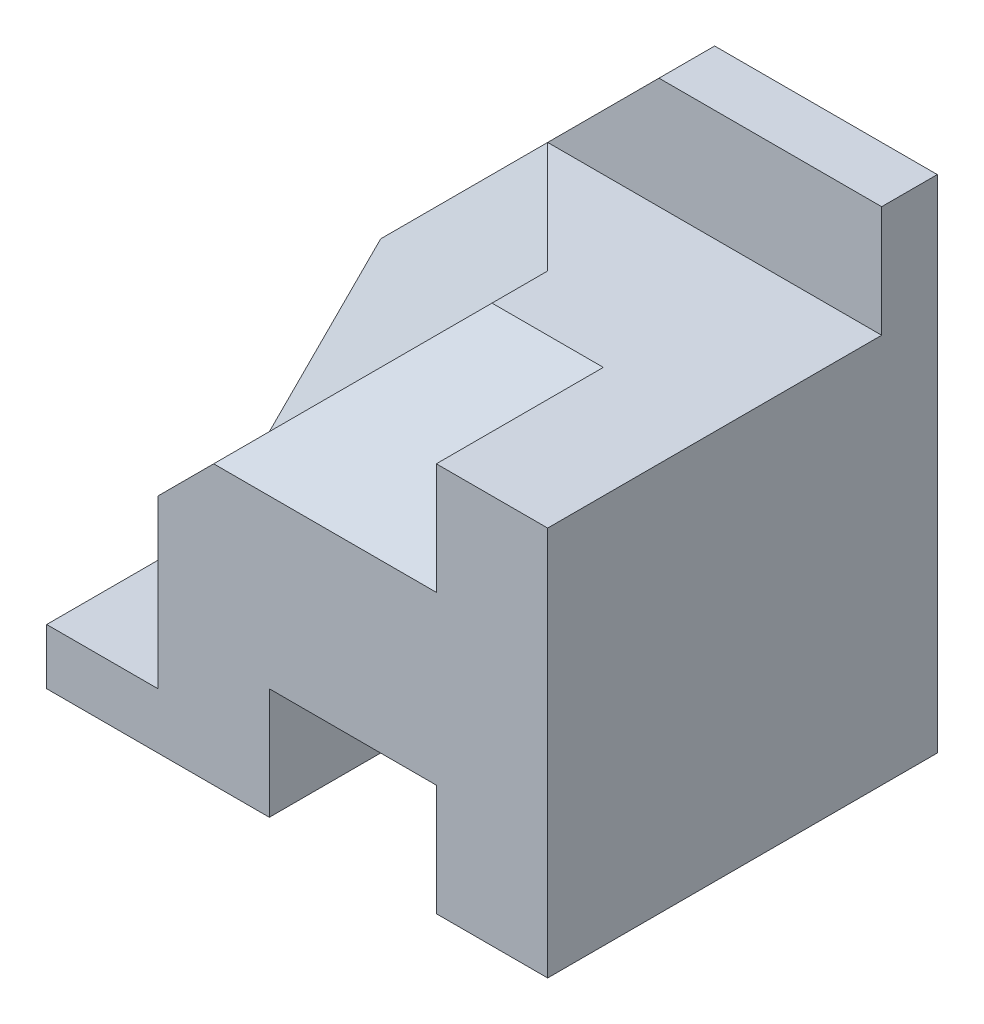
ISO-10303-21;
HEADER;
FILE_DESCRIPTION(('STEP AP214'),'2;1');
FILE_NAME('part.step','',(''),(''),'','','');
FILE_SCHEMA(('AUTOMOTIVE_DESIGN { 1 0 10303 214 1 1 1 1 }'));
ENDSEC;
DATA;
#1=APPLICATION_CONTEXT('core data for automotive mechanical design processes');
#2=APPLICATION_PROTOCOL_DEFINITION('international standard','automotive_design',2000,#1);
#3=PRODUCT_CONTEXT('',#1,'mechanical');
#4=PRODUCT('Part','Part','',(#3));
#5=PRODUCT_RELATED_PRODUCT_CATEGORY('part','',(#4));
#6=PRODUCT_DEFINITION_FORMATION('','',#4);
#7=PRODUCT_DEFINITION_CONTEXT('part definition',#1,'design');
#8=PRODUCT_DEFINITION('design','',#6,#7);
#9=PRODUCT_DEFINITION_SHAPE('','',#8);
#10=(LENGTH_UNIT() NAMED_UNIT(*) SI_UNIT(.MILLI.,.METRE.));
#11=(NAMED_UNIT(*) PLANE_ANGLE_UNIT() SI_UNIT($,.RADIAN.));
#12=(NAMED_UNIT(*) SI_UNIT($,.STERADIAN.) SOLID_ANGLE_UNIT());
#13=UNCERTAINTY_MEASURE_WITH_UNIT(LENGTH_MEASURE(1.E-05),#10,'distance_accuracy_value','');
#14=(GEOMETRIC_REPRESENTATION_CONTEXT(3) GLOBAL_UNCERTAINTY_ASSIGNED_CONTEXT((#13)) GLOBAL_UNIT_ASSIGNED_CONTEXT((#10,
#11,#12)) REPRESENTATION_CONTEXT('',''));
#15=CARTESIAN_POINT('',(0.,0.,0.));
#16=DIRECTION('',(0.,0.,1.));
#17=DIRECTION('',(1.,0.,0.));
#18=AXIS2_PLACEMENT_3D('',#15,#16,#17);
#19=CARTESIAN_POINT('',(9.,7.,7.));
#20=DIRECTION('',(0.,-1.,0.));
#21=DIRECTION('',(1.,0.,0.));
#22=AXIS2_PLACEMENT_3D('',#19,#20,#21);
#23=PLANE('',#22);
#24=DIRECTION('',(0.707106781186547,0.,0.707106781186548));
#25=VECTOR('',#24,1.);
#26=CARTESIAN_POINT('',(3.,7.,1.));
#27=LINE('',#26,#25);
#28=CARTESIAN_POINT('',(3.,7.,1.));
#29=VERTEX_POINT('',#28);
#30=CARTESIAN_POINT('',(5.,7.,3.));
#31=VERTEX_POINT('',#30);
#32=EDGE_CURVE('E169',#29,#31,#27,.T.);
#33=ORIENTED_EDGE('',*,*,#32,.T.);
#34=DIRECTION('',(0.,0.,1.));
#35=VECTOR('',#34,1.);
#36=CARTESIAN_POINT('',(5.,7.,3.));
#37=LINE('',#36,#35);
#38=CARTESIAN_POINT('',(5.,7.,4.));
#39=VERTEX_POINT('',#38);
#40=EDGE_CURVE('E327',#31,#39,#37,.T.);
#41=ORIENTED_EDGE('',*,*,#40,.T.);
#42=DIRECTION('',(1.,0.,0.));
#43=VECTOR('',#42,1.);
#44=CARTESIAN_POINT('',(5.,7.,4.));
#45=LINE('',#44,#43);
#46=CARTESIAN_POINT('',(7.,7.,4.));
#47=VERTEX_POINT('',#46);
#48=EDGE_CURVE('E242',#39,#47,#45,.T.);
#49=ORIENTED_EDGE('',*,*,#48,.T.);
#50=DIRECTION('',(0.,0.,-1.));
#51=VECTOR('',#50,1.);
#52=CARTESIAN_POINT('',(7.,7.,7.));
#53=LINE('',#52,#51);
#54=CARTESIAN_POINT('',(7.,7.,7.));
#55=VERTEX_POINT('',#54);
#56=EDGE_CURVE('E245',#55,#47,#53,.T.);
#57=ORIENTED_EDGE('',*,*,#56,.F.);
#58=DIRECTION('',(-1.,0.,0.));
#59=VECTOR('',#58,1.);
#60=CARTESIAN_POINT('',(9.,7.,7.));
#61=LINE('',#60,#59);
#62=CARTESIAN_POINT('',(9.,7.,7.));
#63=VERTEX_POINT('',#62);
#64=EDGE_CURVE('E267',#63,#55,#61,.T.);
#65=ORIENTED_EDGE('',*,*,#64,.F.);
#66=DIRECTION('',(0.,0.,-1.));
#67=VECTOR('',#66,1.);
#68=CARTESIAN_POINT('',(9.,7.,7.));
#69=LINE('',#68,#67);
#70=CARTESIAN_POINT('',(9.,7.,1.));
#71=VERTEX_POINT('',#70);
#72=EDGE_CURVE('E276',#63,#71,#69,.T.);
#73=ORIENTED_EDGE('',*,*,#72,.T.);
#74=DIRECTION('',(-1.,0.,0.));
#75=VECTOR('',#74,1.);
#76=CARTESIAN_POINT('',(9.,7.,1.));
#77=LINE('',#76,#75);
#78=EDGE_CURVE('E261',#71,#29,#77,.T.);
#79=ORIENTED_EDGE('',*,*,#78,.T.);
#80=EDGE_LOOP('',(#33,#41,#49,#57,#65,#73,#79));
#81=FACE_BOUND('',#80,.T.);
#82=ADVANCED_FACE('F38',(#81),#23,.F.);
#83=CARTESIAN_POINT('',(0.,0.,1.));
#84=DIRECTION('',(1.,0.,0.));
#85=DIRECTION('',(0.,0.,-1.));
#86=AXIS2_PLACEMENT_3D('',#83,#84,#85);
#87=PLANE('',#86);
#88=DIRECTION('',(0.,0.707106781186547,-0.707106781186548));
#89=VECTOR('',#88,1.);
#90=CARTESIAN_POINT('',(0.,2.,3.));
#91=LINE('',#90,#89);
#92=CARTESIAN_POINT('',(0.,2.,3.));
#93=VERTEX_POINT('',#92);
#94=CARTESIAN_POINT('',(0.,4.,1.));
#95=VERTEX_POINT('',#94);
#96=EDGE_CURVE('E166',#93,#95,#91,.T.);
#97=ORIENTED_EDGE('',*,*,#96,.T.);
#98=DIRECTION('',(0.,0.,-1.));
#99=VECTOR('',#98,1.);
#100=CARTESIAN_POINT('',(0.,4.,1.));
#101=LINE('',#100,#99);
#102=CARTESIAN_POINT('',(0.,4.,0.));
#103=VERTEX_POINT('',#102);
#104=EDGE_CURVE('E181',#95,#103,#101,.T.);
#105=ORIENTED_EDGE('',*,*,#104,.T.);
#106=DIRECTION('',(0.,-1.,0.));
#107=VECTOR('',#106,1.);
#108=CARTESIAN_POINT('',(0.,0.,0.));
#109=LINE('',#108,#107);
#110=CARTESIAN_POINT('',(0.,0.,0.));
#111=VERTEX_POINT('',#110);
#112=EDGE_CURVE('E286',#103,#111,#109,.T.);
#113=ORIENTED_EDGE('',*,*,#112,.T.);
#114=DIRECTION('',(0.,0.,-1.));
#115=VECTOR('',#114,1.);
#116=CARTESIAN_POINT('',(0.,0.,1.));
#117=LINE('',#116,#115);
#118=CARTESIAN_POINT('',(0.,0.,7.));
#119=VERTEX_POINT('',#118);
#120=EDGE_CURVE('E12',#119,#111,#117,.T.);
#121=ORIENTED_EDGE('',*,*,#120,.F.);
#122=DIRECTION('',(0.,-1.,0.));
#123=VECTOR('',#122,1.);
#124=CARTESIAN_POINT('',(0.,7.,7.));
#125=LINE('',#124,#123);
#126=CARTESIAN_POINT('',(0.,0.999999999999998,7.));
#127=VERTEX_POINT('',#126);
#128=EDGE_CURVE('E270',#127,#119,#125,.T.);
#129=ORIENTED_EDGE('',*,*,#128,.F.);
#130=DIRECTION('',(0.,0.,1.));
#131=VECTOR('',#130,1.);
#132=CARTESIAN_POINT('',(0.,0.999999999999998,7.));
#133=LINE('',#132,#131);
#134=CARTESIAN_POINT('',(0.,0.999999999999998,4.));
#135=VERTEX_POINT('',#134);
#136=EDGE_CURVE('E357',#135,#127,#133,.T.);
#137=ORIENTED_EDGE('',*,*,#136,.F.);
#138=DIRECTION('',(0.,1.,0.));
#139=VECTOR('',#138,1.);
#140=CARTESIAN_POINT('',(0.,0.999999999999998,4.));
#141=LINE('',#140,#139);
#142=CARTESIAN_POINT('',(0.,2.,4.));
#143=VERTEX_POINT('',#142);
#144=EDGE_CURVE('E202',#135,#143,#141,.T.);
#145=ORIENTED_EDGE('',*,*,#144,.T.);
#146=DIRECTION('',(0.,0.,-1.));
#147=VECTOR('',#146,1.);
#148=CARTESIAN_POINT('',(0.,2.,4.));
#149=LINE('',#148,#147);
#150=EDGE_CURVE('E184',#143,#93,#149,.T.);
#151=ORIENTED_EDGE('',*,*,#150,.T.);
#152=EDGE_LOOP('',(#97,#105,#113,#121,#129,#137,#145,#151));
#153=FACE_BOUND('',#152,.T.);
#154=ADVANCED_FACE('F40',(#153),#87,.F.);
#155=CARTESIAN_POINT('',(0.,0.,7.));
#156=DIRECTION('',(0.,0.,-1.));
#157=DIRECTION('',(-1.,0.,0.));
#158=AXIS2_PLACEMENT_3D('',#155,#156,#157);
#159=PLANE('',#158);
#160=DIRECTION('',(-0.707106781186547,-0.707106781186548,0.));
#161=VECTOR('',#160,1.);
#162=CARTESIAN_POINT('',(3.,5.,7.));
#163=LINE('',#162,#161);
#164=CARTESIAN_POINT('',(3.,5.,7.));
#165=VERTEX_POINT('',#164);
#166=CARTESIAN_POINT('',(2.,4.,7.));
#167=VERTEX_POINT('',#166);
#168=EDGE_CURVE('E333',#165,#167,#163,.T.);
#169=ORIENTED_EDGE('',*,*,#168,.T.);
#170=DIRECTION('',(0.,1.,0.));
#171=VECTOR('',#170,1.);
#172=CARTESIAN_POINT('',(2.,0.999999999999998,7.));
#173=LINE('',#172,#171);
#174=CARTESIAN_POINT('',(2.,0.999999999999998,7.));
#175=VERTEX_POINT('',#174);
#176=EDGE_CURVE('E203',#175,#167,#173,.T.);
#177=ORIENTED_EDGE('',*,*,#176,.F.);
#178=DIRECTION('',(1.,0.,0.));
#179=VECTOR('',#178,1.);
#180=CARTESIAN_POINT('',(2.,0.999999999999998,7.));
#181=LINE('',#180,#179);
#182=EDGE_CURVE('E335',#127,#175,#181,.T.);
#183=ORIENTED_EDGE('',*,*,#182,.F.);
#184=ORIENTED_EDGE('',*,*,#128,.T.);
#185=DIRECTION('',(1.,0.,0.));
#186=VECTOR('',#185,1.);
#187=CARTESIAN_POINT('',(9.,0.,7.));
#188=LINE('',#187,#186);
#189=CARTESIAN_POINT('',(4.,0.,7.));
#190=VERTEX_POINT('',#189);
#191=EDGE_CURVE('E273',#119,#190,#188,.T.);
#192=ORIENTED_EDGE('',*,*,#191,.T.);
#193=DIRECTION('',(0.,-1.,0.));
#194=VECTOR('',#193,1.);
#195=CARTESIAN_POINT('',(4.,0.,7.));
#196=LINE('',#195,#194);
#197=CARTESIAN_POINT('',(4.,2.,7.));
#198=VERTEX_POINT('',#197);
#199=EDGE_CURVE('E222',#198,#190,#196,.T.);
#200=ORIENTED_EDGE('',*,*,#199,.F.);
#201=DIRECTION('',(-1.,0.,0.));
#202=VECTOR('',#201,1.);
#203=CARTESIAN_POINT('',(4.,2.,7.));
#204=LINE('',#203,#202);
#205=CARTESIAN_POINT('',(7.,2.,7.));
#206=VERTEX_POINT('',#205);
#207=EDGE_CURVE('E215',#206,#198,#204,.T.);
#208=ORIENTED_EDGE('',*,*,#207,.F.);
#209=DIRECTION('',(0.,1.,0.));
#210=VECTOR('',#209,1.);
#211=CARTESIAN_POINT('',(7.,0.,7.));
#212=LINE('',#211,#210);
#213=CARTESIAN_POINT('',(7.,0.,7.));
#214=VERTEX_POINT('',#213);
#215=EDGE_CURVE('E224',#214,#206,#212,.T.);
#216=ORIENTED_EDGE('',*,*,#215,.F.);
#217=CARTESIAN_POINT('',(9.,0.,7.));
#218=VERTEX_POINT('',#217);
#219=EDGE_CURVE('E272',#214,#218,#188,.T.);
#220=ORIENTED_EDGE('',*,*,#219,.T.);
#221=DIRECTION('',(0.,1.,0.));
#222=VECTOR('',#221,1.);
#223=CARTESIAN_POINT('',(9.,7.,7.));
#224=LINE('',#223,#222);
#225=EDGE_CURVE('E264',#218,#63,#224,.T.);
#226=ORIENTED_EDGE('',*,*,#225,.T.);
#227=ORIENTED_EDGE('',*,*,#64,.T.);
#228=DIRECTION('',(0.,1.,0.));
#229=VECTOR('',#228,1.);
#230=CARTESIAN_POINT('',(7.,5.,7.));
#231=LINE('',#230,#229);
#232=CARTESIAN_POINT('',(7.,5.,7.));
#233=VERTEX_POINT('',#232);
#234=EDGE_CURVE('E239',#233,#55,#231,.T.);
#235=ORIENTED_EDGE('',*,*,#234,.F.);
#236=DIRECTION('',(-1.,0.,0.));
#237=VECTOR('',#236,1.);
#238=CARTESIAN_POINT('',(7.,5.,7.));
#239=LINE('',#238,#237);
#240=EDGE_CURVE('E250',#233,#165,#239,.T.);
#241=ORIENTED_EDGE('',*,*,#240,.T.);
#242=EDGE_LOOP('',(#169,#177,#183,#184,#192,#200,#208,#216,#220,#226,#227,#235,#241));
#243=FACE_BOUND('',#242,.T.);
#244=ADVANCED_FACE('F365',(#243),#159,.F.);
#245=CARTESIAN_POINT('',(0.,0.999999999999998,4.));
#246=DIRECTION('',(0.707106781186548,0.,-0.707106781186547));
#247=DIRECTION('',(-0.707106781186547,0.,-0.707106781186548));
#248=AXIS2_PLACEMENT_3D('',#245,#246,#247);
#249=PLANE('',#248);
#250=DIRECTION('',(-0.577350269189626,-0.577350269189626,-0.577350269189626));
#251=VECTOR('',#250,1.);
#252=CARTESIAN_POINT('',(2.,4.,6.));
#253=LINE('',#252,#251);
#254=CARTESIAN_POINT('',(2.,4.,6.));
#255=VERTEX_POINT('',#254);
#256=EDGE_CURVE('E56',#255,#143,#253,.T.);
#257=ORIENTED_EDGE('',*,*,#256,.T.);
#258=ORIENTED_EDGE('',*,*,#144,.F.);
#259=DIRECTION('',(-0.707106781186547,0.,-0.707106781186548));
#260=VECTOR('',#259,1.);
#261=CARTESIAN_POINT('',(0.,0.999999999999998,4.));
#262=LINE('',#261,#260);
#263=CARTESIAN_POINT('',(2.,0.999999999999998,6.));
#264=VERTEX_POINT('',#263);
#265=EDGE_CURVE('E64',#264,#135,#262,.T.);
#266=ORIENTED_EDGE('',*,*,#265,.F.);
#267=DIRECTION('',(0.,1.,0.));
#268=VECTOR('',#267,1.);
#269=CARTESIAN_POINT('',(2.,0.999999999999998,6.));
#270=LINE('',#269,#268);
#271=EDGE_CURVE('E198',#264,#255,#270,.T.);
#272=ORIENTED_EDGE('',*,*,#271,.T.);
#273=EDGE_LOOP('',(#257,#258,#266,#272));
#274=FACE_BOUND('',#273,.T.);
#275=ADVANCED_FACE('F391',(#274),#249,.F.);
#276=CARTESIAN_POINT('',(2.,0.999999999999998,6.));
#277=DIRECTION('',(1.,0.,0.));
#278=DIRECTION('',(0.,0.,-1.));
#279=AXIS2_PLACEMENT_3D('',#276,#277,#278);
#280=PLANE('',#279);
#281=DIRECTION('',(0.,0.,-1.));
#282=VECTOR('',#281,1.);
#283=CARTESIAN_POINT('',(2.,4.,7.));
#284=LINE('',#283,#282);
#285=EDGE_CURVE('E338',#167,#255,#284,.T.);
#286=ORIENTED_EDGE('',*,*,#285,.T.);
#287=ORIENTED_EDGE('',*,*,#271,.F.);
#288=DIRECTION('',(0.,0.,-1.));
#289=VECTOR('',#288,1.);
#290=CARTESIAN_POINT('',(2.,0.999999999999998,6.));
#291=LINE('',#290,#289);
#292=EDGE_CURVE('E355',#175,#264,#291,.T.);
#293=ORIENTED_EDGE('',*,*,#292,.F.);
#294=ORIENTED_EDGE('',*,*,#176,.T.);
#295=EDGE_LOOP('',(#286,#287,#293,#294));
#296=FACE_BOUND('',#295,.T.);
#297=ADVANCED_FACE('F363',(#296),#280,.F.);
#298=CARTESIAN_POINT('',(0.,0.,1.));
#299=DIRECTION('',(0.,1.,0.));
#300=DIRECTION('',(0.,0.,1.));
#301=AXIS2_PLACEMENT_3D('',#298,#299,#300);
#302=PLANE('',#301);
#303=DIRECTION('',(1.,0.,0.));
#304=VECTOR('',#303,1.);
#305=CARTESIAN_POINT('',(0.,0.,0.));
#306=LINE('',#305,#304);
#307=CARTESIAN_POINT('',(4.,0.,0.));
#308=VERTEX_POINT('',#307);
#309=EDGE_CURVE('E293',#111,#308,#306,.T.);
#310=ORIENTED_EDGE('',*,*,#309,.T.);
#311=DIRECTION('',(0.,0.,1.));
#312=VECTOR('',#311,1.);
#313=CARTESIAN_POINT('',(4.,0.,0.));
#314=LINE('',#313,#312);
#315=EDGE_CURVE('E221',#308,#190,#314,.T.);
#316=ORIENTED_EDGE('',*,*,#315,.T.);
#317=ORIENTED_EDGE('',*,*,#191,.F.);
#318=ORIENTED_EDGE('',*,*,#120,.T.);
#319=EDGE_LOOP('',(#310,#316,#317,#318));
#320=FACE_BOUND('',#319,.T.);
#321=ADVANCED_FACE('F389',(#320),#302,.F.);
#322=CARTESIAN_POINT('',(0.,0.,1.));
#323=DIRECTION('',(0.,0.,-1.));
#324=DIRECTION('',(-1.,0.,0.));
#325=AXIS2_PLACEMENT_3D('',#322,#323,#324);
#326=PLANE('',#325);
#327=ORIENTED_EDGE('',*,*,#78,.F.);
#328=DIRECTION('',(0.,1.,0.));
#329=VECTOR('',#328,1.);
#330=CARTESIAN_POINT('',(9.,0.,1.));
#331=LINE('',#330,#329);
#332=CARTESIAN_POINT('',(9.,9.,1.));
#333=VERTEX_POINT('',#332);
#334=EDGE_CURVE('E284',#71,#333,#331,.T.);
#335=ORIENTED_EDGE('',*,*,#334,.T.);
#336=DIRECTION('',(-1.,0.,0.));
#337=VECTOR('',#336,1.);
#338=CARTESIAN_POINT('',(5.,9.,1.));
#339=LINE('',#338,#337);
#340=CARTESIAN_POINT('',(5.,9.,1.));
#341=VERTEX_POINT('',#340);
#342=EDGE_CURVE('E175',#333,#341,#339,.T.);
#343=ORIENTED_EDGE('',*,*,#342,.T.);
#344=DIRECTION('',(-0.707106781186548,-0.707106781186548,0.));
#345=VECTOR('',#344,1.);
#346=CARTESIAN_POINT('',(0.,4.,1.));
#347=LINE('',#346,#345);
#348=EDGE_CURVE('E42',#341,#29,#347,.T.);
#349=ORIENTED_EDGE('',*,*,#348,.T.);
#350=EDGE_LOOP('',(#327,#335,#343,#349));
#351=FACE_BOUND('',#350,.T.);
#352=ADVANCED_FACE('F323',(#351),#326,.F.);
#353=ORIENTED_EDGE('',*,*,#219,.F.);
#354=DIRECTION('',(0.,0.,1.));
#355=VECTOR('',#354,1.);
#356=CARTESIAN_POINT('',(7.,0.,0.));
#357=LINE('',#356,#355);
#358=CARTESIAN_POINT('',(7.,0.,0.));
#359=VERTEX_POINT('',#358);
#360=EDGE_CURVE('E234',#359,#214,#357,.T.);
#361=ORIENTED_EDGE('',*,*,#360,.F.);
#362=CARTESIAN_POINT('',(9.,0.,0.));
#363=VERTEX_POINT('',#362);
#364=EDGE_CURVE('E290',#359,#363,#306,.T.);
#365=ORIENTED_EDGE('',*,*,#364,.T.);
#366=DIRECTION('',(0.,0.,-1.));
#367=VECTOR('',#366,1.);
#368=CARTESIAN_POINT('',(9.,0.,1.));
#369=LINE('',#368,#367);
#370=EDGE_CURVE('E48',#218,#363,#369,.T.);
#371=ORIENTED_EDGE('',*,*,#370,.F.);
#372=EDGE_LOOP('',(#353,#361,#365,#371));
#373=FACE_BOUND('',#372,.T.);
#374=ADVANCED_FACE('F377',(#373),#302,.F.);
#375=CARTESIAN_POINT('',(9.,0.,1.));
#376=DIRECTION('',(-1.,0.,0.));
#377=DIRECTION('',(0.,0.,1.));
#378=AXIS2_PLACEMENT_3D('',#375,#376,#377);
#379=PLANE('',#378);
#380=DIRECTION('',(0.,1.,0.));
#381=VECTOR('',#380,1.);
#382=CARTESIAN_POINT('',(9.,0.,0.));
#383=LINE('',#382,#381);
#384=CARTESIAN_POINT('',(9.,9.,0.));
#385=VERTEX_POINT('',#384);
#386=EDGE_CURVE('E298',#363,#385,#383,.T.);
#387=ORIENTED_EDGE('',*,*,#386,.T.);
#388=DIRECTION('',(0.,0.,-1.));
#389=VECTOR('',#388,1.);
#390=CARTESIAN_POINT('',(9.,9.,1.));
#391=LINE('',#390,#389);
#392=EDGE_CURVE('E192',#333,#385,#391,.T.);
#393=ORIENTED_EDGE('',*,*,#392,.F.);
#394=ORIENTED_EDGE('',*,*,#334,.F.);
#395=ORIENTED_EDGE('',*,*,#72,.F.);
#396=ORIENTED_EDGE('',*,*,#225,.F.);
#397=ORIENTED_EDGE('',*,*,#370,.T.);
#398=EDGE_LOOP('',(#387,#393,#394,#395,#396,#397));
#399=FACE_BOUND('',#398,.T.);
#400=ADVANCED_FACE('F310',(#399),#379,.F.);
#401=CARTESIAN_POINT('',(5.,9.,1.));
#402=DIRECTION('',(0.,-1.,0.));
#403=DIRECTION('',(0.,0.,-1.));
#404=AXIS2_PLACEMENT_3D('',#401,#402,#403);
#405=PLANE('',#404);
#406=DIRECTION('',(-1.,0.,0.));
#407=VECTOR('',#406,1.);
#408=CARTESIAN_POINT('',(5.,9.,0.));
#409=LINE('',#408,#407);
#410=CARTESIAN_POINT('',(5.,9.,0.));
#411=VERTEX_POINT('',#410);
#412=EDGE_CURVE('E300',#385,#411,#409,.T.);
#413=ORIENTED_EDGE('',*,*,#412,.T.);
#414=DIRECTION('',(0.,0.,-1.));
#415=VECTOR('',#414,1.);
#416=CARTESIAN_POINT('',(5.,9.,1.));
#417=LINE('',#416,#415);
#418=EDGE_CURVE('E190',#341,#411,#417,.T.);
#419=ORIENTED_EDGE('',*,*,#418,.F.);
#420=ORIENTED_EDGE('',*,*,#342,.F.);
#421=ORIENTED_EDGE('',*,*,#392,.T.);
#422=EDGE_LOOP('',(#413,#419,#420,#421));
#423=FACE_BOUND('',#422,.T.);
#424=ADVANCED_FACE('F320',(#423),#405,.F.);
#425=CARTESIAN_POINT('',(0.,4.,1.));
#426=DIRECTION('',(0.707106781186547,-0.707106781186547,0.));
#427=DIRECTION('',(0.707106781186548,0.707106781186548,0.));
#428=AXIS2_PLACEMENT_3D('',#425,#426,#427);
#429=PLANE('',#428);
#430=DIRECTION('',(-0.707106781186548,-0.707106781186548,0.));
#431=VECTOR('',#430,1.);
#432=CARTESIAN_POINT('',(0.,4.,0.));
#433=LINE('',#432,#431);
#434=EDGE_CURVE('E189',#411,#103,#433,.T.);
#435=ORIENTED_EDGE('',*,*,#434,.T.);
#436=ORIENTED_EDGE('',*,*,#104,.F.);
#437=EDGE_CURVE('E163',#29,#95,#347,.T.);
#438=ORIENTED_EDGE('',*,*,#437,.F.);
#439=ORIENTED_EDGE('',*,*,#348,.F.);
#440=ORIENTED_EDGE('',*,*,#418,.T.);
#441=EDGE_LOOP('',(#435,#436,#438,#439,#440));
#442=FACE_BOUND('',#441,.T.);
#443=ADVANCED_FACE('F186',(#442),#429,.F.);
#444=CARTESIAN_POINT('',(0.,0.,0.));
#445=DIRECTION('',(0.,0.,-1.));
#446=DIRECTION('',(-1.,0.,0.));
#447=AXIS2_PLACEMENT_3D('',#444,#445,#446);
#448=PLANE('',#447);
#449=DIRECTION('',(0.,-1.,0.));
#450=VECTOR('',#449,1.);
#451=CARTESIAN_POINT('',(4.,0.,0.));
#452=LINE('',#451,#450);
#453=CARTESIAN_POINT('',(4.,2.,0.));
#454=VERTEX_POINT('',#453);
#455=EDGE_CURVE('E211',#454,#308,#452,.T.);
#456=ORIENTED_EDGE('',*,*,#455,.T.);
#457=ORIENTED_EDGE('',*,*,#309,.F.);
#458=ORIENTED_EDGE('',*,*,#112,.F.);
#459=ORIENTED_EDGE('',*,*,#434,.F.);
#460=ORIENTED_EDGE('',*,*,#412,.F.);
#461=ORIENTED_EDGE('',*,*,#386,.F.);
#462=ORIENTED_EDGE('',*,*,#364,.F.);
#463=DIRECTION('',(0.,1.,0.));
#464=VECTOR('',#463,1.);
#465=CARTESIAN_POINT('',(7.,0.,0.));
#466=LINE('',#465,#464);
#467=CARTESIAN_POINT('',(7.,2.,0.));
#468=VERTEX_POINT('',#467);
#469=EDGE_CURVE('E214',#359,#468,#466,.T.);
#470=ORIENTED_EDGE('',*,*,#469,.T.);
#471=DIRECTION('',(-1.,0.,0.));
#472=VECTOR('',#471,1.);
#473=CARTESIAN_POINT('',(4.,2.,0.));
#474=LINE('',#473,#472);
#475=EDGE_CURVE('E218',#468,#454,#474,.T.);
#476=ORIENTED_EDGE('',*,*,#475,.T.);
#477=EDGE_LOOP('',(#456,#457,#458,#459,#460,#461,#462,#470,#476));
#478=FACE_BOUND('',#477,.T.);
#479=ADVANCED_FACE('F317',(#478),#448,.T.);
#480=CARTESIAN_POINT('',(7.,7.,4.));
#481=DIRECTION('',(-1.,0.,0.));
#482=DIRECTION('',(0.,-1.,0.));
#483=AXIS2_PLACEMENT_3D('',#480,#481,#482);
#484=PLANE('',#483);
#485=ORIENTED_EDGE('',*,*,#56,.T.);
#486=DIRECTION('',(0.,-0.554700196225229,0.832050294337844));
#487=VECTOR('',#486,1.);
#488=CARTESIAN_POINT('',(7.,7.,4.));
#489=LINE('',#488,#487);
#490=EDGE_CURVE('E246',#47,#233,#489,.T.);
#491=ORIENTED_EDGE('',*,*,#490,.T.);
#492=ORIENTED_EDGE('',*,*,#234,.T.);
#493=EDGE_LOOP('',(#485,#491,#492));
#494=FACE_BOUND('',#493,.T.);
#495=ADVANCED_FACE('F416',(#494),#484,.T.);
#496=CARTESIAN_POINT('',(0.,6.69230769230769,4.46153846153846));
#497=DIRECTION('',(0.,-0.832050294337844,-0.554700196225228));
#498=DIRECTION('',(0.,0.554700196225228,-0.832050294337844));
#499=AXIS2_PLACEMENT_3D('',#496,#497,#498);
#500=PLANE('',#499);
#501=DIRECTION('',(0.485071250072666,0.485071250072666,-0.727606875108999));
#502=VECTOR('',#501,1.);
#503=CARTESIAN_POINT('',(3.,5.,7.));
#504=LINE('',#503,#502);
#505=EDGE_CURVE('E231',#165,#39,#504,.T.);
#506=ORIENTED_EDGE('',*,*,#505,.F.);
#507=ORIENTED_EDGE('',*,*,#240,.F.);
#508=ORIENTED_EDGE('',*,*,#490,.F.);
#509=ORIENTED_EDGE('',*,*,#48,.F.);
#510=EDGE_LOOP('',(#506,#507,#508,#509));
#511=FACE_BOUND('',#510,.T.);
#512=ADVANCED_FACE('F370',(#511),#500,.F.);
#513=CARTESIAN_POINT('',(4.,0.,0.));
#514=DIRECTION('',(-1.,0.,0.));
#515=DIRECTION('',(0.,0.,1.));
#516=AXIS2_PLACEMENT_3D('',#513,#514,#515);
#517=PLANE('',#516);
#518=ORIENTED_EDGE('',*,*,#199,.T.);
#519=ORIENTED_EDGE('',*,*,#315,.F.);
#520=ORIENTED_EDGE('',*,*,#455,.F.);
#521=DIRECTION('',(0.,0.,1.));
#522=VECTOR('',#521,1.);
#523=CARTESIAN_POINT('',(4.,2.,0.));
#524=LINE('',#523,#522);
#525=EDGE_CURVE('E229',#454,#198,#524,.T.);
#526=ORIENTED_EDGE('',*,*,#525,.T.);
#527=EDGE_LOOP('',(#518,#519,#520,#526));
#528=FACE_BOUND('',#527,.T.);
#529=ADVANCED_FACE('F386',(#528),#517,.F.);
#530=CARTESIAN_POINT('',(4.,2.,0.));
#531=DIRECTION('',(0.,1.,0.));
#532=DIRECTION('',(0.,0.,1.));
#533=AXIS2_PLACEMENT_3D('',#530,#531,#532);
#534=PLANE('',#533);
#535=ORIENTED_EDGE('',*,*,#207,.T.);
#536=ORIENTED_EDGE('',*,*,#525,.F.);
#537=ORIENTED_EDGE('',*,*,#475,.F.);
#538=DIRECTION('',(0.,0.,1.));
#539=VECTOR('',#538,1.);
#540=CARTESIAN_POINT('',(7.,2.,0.));
#541=LINE('',#540,#539);
#542=EDGE_CURVE('E232',#468,#206,#541,.T.);
#543=ORIENTED_EDGE('',*,*,#542,.T.);
#544=EDGE_LOOP('',(#535,#536,#537,#543));
#545=FACE_BOUND('',#544,.T.);
#546=ADVANCED_FACE('F383',(#545),#534,.F.);
#547=CARTESIAN_POINT('',(7.,0.,0.));
#548=DIRECTION('',(1.,0.,0.));
#549=DIRECTION('',(0.,0.,-1.));
#550=AXIS2_PLACEMENT_3D('',#547,#548,#549);
#551=PLANE('',#550);
#552=ORIENTED_EDGE('',*,*,#215,.T.);
#553=ORIENTED_EDGE('',*,*,#542,.F.);
#554=ORIENTED_EDGE('',*,*,#469,.F.);
#555=ORIENTED_EDGE('',*,*,#360,.T.);
#556=EDGE_LOOP('',(#552,#553,#554,#555));
#557=FACE_BOUND('',#556,.T.);
#558=ADVANCED_FACE('F379',(#557),#551,.F.);
#559=CARTESIAN_POINT('',(0.,0.999999999999998,0.));
#560=DIRECTION('',(0.,-1.,0.));
#561=DIRECTION('',(0.,0.,-1.));
#562=AXIS2_PLACEMENT_3D('',#559,#560,#561);
#563=PLANE('',#562);
#564=ORIENTED_EDGE('',*,*,#182,.T.);
#565=ORIENTED_EDGE('',*,*,#292,.T.);
#566=ORIENTED_EDGE('',*,*,#265,.T.);
#567=ORIENTED_EDGE('',*,*,#136,.T.);
#568=EDGE_LOOP('',(#564,#565,#566,#567));
#569=FACE_BOUND('',#568,.T.);
#570=ADVANCED_FACE('F392',(#569),#563,.F.);
#571=CARTESIAN_POINT('',(-1.,1.,0.));
#572=DIRECTION('',(-0.707106781186548,0.707106781186548,0.));
#573=DIRECTION('',(-0.707106781186548,-0.707106781186548,0.));
#574=AXIS2_PLACEMENT_3D('',#571,#572,#573);
#575=PLANE('',#574);
#576=DIRECTION('',(0.707106781186548,0.707106781186547,0.));
#577=VECTOR('',#576,1.);
#578=CARTESIAN_POINT('',(0.,2.,3.));
#579=LINE('',#578,#577);
#580=EDGE_CURVE('E331',#93,#31,#579,.T.);
#581=ORIENTED_EDGE('',*,*,#580,.F.);
#582=ORIENTED_EDGE('',*,*,#150,.F.);
#583=ORIENTED_EDGE('',*,*,#256,.F.);
#584=ORIENTED_EDGE('',*,*,#285,.F.);
#585=ORIENTED_EDGE('',*,*,#168,.F.);
#586=ORIENTED_EDGE('',*,*,#505,.T.);
#587=ORIENTED_EDGE('',*,*,#40,.F.);
#588=EDGE_LOOP('',(#581,#582,#583,#584,#585,#586,#587));
#589=FACE_BOUND('',#588,.T.);
#590=ADVANCED_FACE('F330',(#589),#575,.T.);
#591=CARTESIAN_POINT('',(-1.66666666666667,1.66666666666667,1.66666666666667));
#592=DIRECTION('',(-0.577350269189626,0.577350269189626,0.577350269189626));
#593=DIRECTION('',(0.,-0.707106781186547,0.707106781186548));
#594=AXIS2_PLACEMENT_3D('',#591,#592,#593);
#595=PLANE('',#594);
#596=ORIENTED_EDGE('',*,*,#580,.T.);
#597=ORIENTED_EDGE('',*,*,#32,.F.);
#598=ORIENTED_EDGE('',*,*,#437,.T.);
#599=ORIENTED_EDGE('',*,*,#96,.F.);
#600=EDGE_LOOP('',(#596,#597,#598,#599));
#601=FACE_BOUND('',#600,.T.);
#602=ADVANCED_FACE('F165',(#601),#595,.T.);
#603=CLOSED_SHELL('',(#82,#154,#244,#275,#297,#321,#352,#374,#400,#424,#443,#479,#495,#512,#529,
#546,#558,#570,#590,#602));
#604=MANIFOLD_SOLID_BREP('B2',#603);
#605=ADVANCED_BREP_SHAPE_REPRESENTATION('',(#18,#604),#14);
#606=SHAPE_DEFINITION_REPRESENTATION(#9,#605);
ENDSEC;
END-ISO-10303-21;
